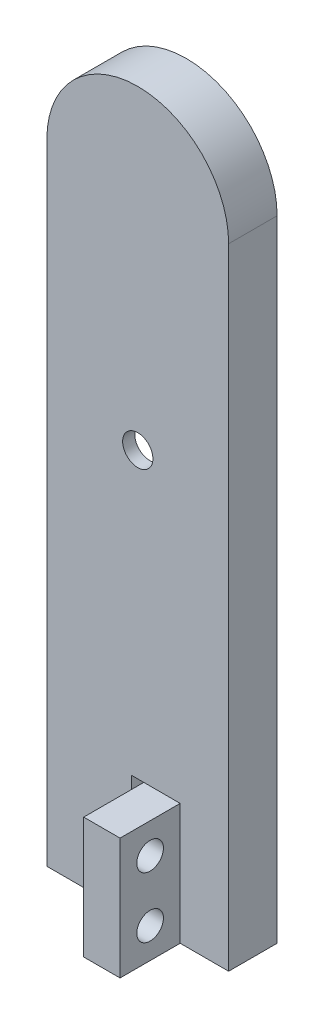
ISO-10303-21;
HEADER;
FILE_DESCRIPTION(('STEP AP214'),'2;1');
FILE_NAME('part.step','',(''),(''),'','','');
FILE_SCHEMA(('AUTOMOTIVE_DESIGN { 1 0 10303 214 1 1 1 1 }'));
ENDSEC;
DATA;
#1=APPLICATION_CONTEXT('core data for automotive mechanical design processes');
#2=APPLICATION_PROTOCOL_DEFINITION('international standard','automotive_design',2000,#1);
#3=PRODUCT_CONTEXT('',#1,'mechanical');
#4=PRODUCT('Part','Part','',(#3));
#5=PRODUCT_RELATED_PRODUCT_CATEGORY('part','',(#4));
#6=PRODUCT_DEFINITION_FORMATION('','',#4);
#7=PRODUCT_DEFINITION_CONTEXT('part definition',#1,'design');
#8=PRODUCT_DEFINITION('design','',#6,#7);
#9=PRODUCT_DEFINITION_SHAPE('','',#8);
#10=(LENGTH_UNIT() NAMED_UNIT(*) SI_UNIT(.MILLI.,.METRE.));
#11=(NAMED_UNIT(*) PLANE_ANGLE_UNIT() SI_UNIT($,.RADIAN.));
#12=(NAMED_UNIT(*) SI_UNIT($,.STERADIAN.) SOLID_ANGLE_UNIT());
#13=UNCERTAINTY_MEASURE_WITH_UNIT(LENGTH_MEASURE(1.E-05),#10,'distance_accuracy_value','');
#14=(GEOMETRIC_REPRESENTATION_CONTEXT(3) GLOBAL_UNCERTAINTY_ASSIGNED_CONTEXT((#13)) GLOBAL_UNIT_ASSIGNED_CONTEXT((#10,
#11,#12)) REPRESENTATION_CONTEXT('',''));
#15=CARTESIAN_POINT('',(0.,0.,0.));
#16=DIRECTION('',(0.,0.,1.));
#17=DIRECTION('',(1.,0.,0.));
#18=AXIS2_PLACEMENT_3D('',#15,#16,#17);
#19=CARTESIAN_POINT('',(0.,52.,4.));
#20=DIRECTION('',(0.,0.,1.));
#21=DIRECTION('',(1.,0.,0.));
#22=AXIS2_PLACEMENT_3D('',#19,#20,#21);
#23=PLANE('',#22);
#24=CARTESIAN_POINT('',(0.,33.5,4.));
#25=DIRECTION('',(0.,0.,1.));
#26=DIRECTION('',(1.,0.,0.));
#27=AXIS2_PLACEMENT_3D('',#24,#25,#26);
#28=CIRCLE('',#27,1.25);
#29=CARTESIAN_POINT('',(1.25,33.5,4.));
#30=VERTEX_POINT('',#29);
#31=EDGE_CURVE('E202',#30,#30,#28,.F.);
#32=ORIENTED_EDGE('',*,*,#31,.T.);
#33=EDGE_LOOP('',(#32));
#34=FACE_BOUND('',#33,.T.);
#35=DIRECTION('',(1.,0.,0.));
#36=VECTOR('',#35,1.);
#37=CARTESIAN_POINT('',(0.,10.,4.));
#38=LINE('',#37,#36);
#39=CARTESIAN_POINT('',(-0.499999999999999,10.,4.));
#40=VERTEX_POINT('',#39);
#41=CARTESIAN_POINT('',(0.499999999999999,10.,4.));
#42=VERTEX_POINT('',#41);
#43=EDGE_CURVE('E199',#40,#42,#38,.T.);
#44=ORIENTED_EDGE('',*,*,#43,.T.);
#45=DIRECTION('',(1.,0.,0.));
#46=VECTOR('',#45,1.);
#47=CARTESIAN_POINT('',(0.,10.,4.));
#48=LINE('',#47,#46);
#49=CARTESIAN_POINT('',(3.5,10.,4.));
#50=VERTEX_POINT('',#49);
#51=EDGE_CURVE('E53',#42,#50,#48,.T.);
#52=ORIENTED_EDGE('',*,*,#51,.T.);
#53=DIRECTION('',(0.,1.,0.));
#54=VECTOR('',#53,1.);
#55=CARTESIAN_POINT('',(3.5,52.,4.));
#56=LINE('',#55,#54);
#57=CARTESIAN_POINT('',(3.5,0.,4.));
#58=VERTEX_POINT('',#57);
#59=EDGE_CURVE('E11',#58,#50,#56,.T.);
#60=ORIENTED_EDGE('',*,*,#59,.F.);
#61=DIRECTION('',(1.,0.,0.));
#62=VECTOR('',#61,1.);
#63=CARTESIAN_POINT('',(7.5,0.,4.));
#64=LINE('',#63,#62);
#65=CARTESIAN_POINT('',(7.5,0.,4.));
#66=VERTEX_POINT('',#65);
#67=EDGE_CURVE('E157',#58,#66,#64,.T.);
#68=ORIENTED_EDGE('',*,*,#67,.T.);
#69=DIRECTION('',(0.,1.,0.));
#70=VECTOR('',#69,1.);
#71=CARTESIAN_POINT('',(7.5,0.,4.));
#72=LINE('',#71,#70);
#73=CARTESIAN_POINT('',(7.5,52.,4.));
#74=VERTEX_POINT('',#73);
#75=EDGE_CURVE('E253',#66,#74,#72,.T.);
#76=ORIENTED_EDGE('',*,*,#75,.T.);
#77=CARTESIAN_POINT('',(0.,52.,4.));
#78=DIRECTION('',(0.,0.,1.));
#79=DIRECTION('',(1.,0.,0.));
#80=AXIS2_PLACEMENT_3D('',#77,#78,#79);
#81=CIRCLE('',#80,7.5);
#82=CARTESIAN_POINT('',(-7.5,52.,4.));
#83=VERTEX_POINT('',#82);
#84=EDGE_CURVE('E255',#74,#83,#81,.T.);
#85=ORIENTED_EDGE('',*,*,#84,.T.);
#86=DIRECTION('',(0.,-1.,0.));
#87=VECTOR('',#86,1.);
#88=CARTESIAN_POINT('',(-7.5,0.,4.));
#89=LINE('',#88,#87);
#90=CARTESIAN_POINT('',(-7.5,0.,4.));
#91=VERTEX_POINT('',#90);
#92=EDGE_CURVE('E257',#83,#91,#89,.T.);
#93=ORIENTED_EDGE('',*,*,#92,.T.);
#94=CARTESIAN_POINT('',(-0.5,0.,4.));
#95=VERTEX_POINT('',#94);
#96=EDGE_CURVE('E250',#91,#95,#64,.T.);
#97=ORIENTED_EDGE('',*,*,#96,.T.);
#98=DIRECTION('',(0.,1.,0.));
#99=VECTOR('',#98,1.);
#100=CARTESIAN_POINT('',(-0.499999999999997,52.,4.));
#101=LINE('',#100,#99);
#102=EDGE_CURVE('E196',#95,#40,#101,.T.);
#103=ORIENTED_EDGE('',*,*,#102,.T.);
#104=EDGE_LOOP('',(#44,#52,#60,#68,#76,#85,#93,#97,#103));
#105=FACE_BOUND('',#104,.T.);
#106=ADVANCED_FACE('F36',(#34,#105),#23,.T.);
#107=CARTESIAN_POINT('',(7.5,0.,4.));
#108=DIRECTION('',(0.,1.,0.));
#109=DIRECTION('',(0.,0.,1.));
#110=AXIS2_PLACEMENT_3D('',#107,#108,#109);
#111=PLANE('',#110);
#112=DIRECTION('',(0.,0.,-1.));
#113=VECTOR('',#112,1.);
#114=CARTESIAN_POINT('',(0.5,0.,16.3));
#115=LINE('',#114,#113);
#116=CARTESIAN_POINT('',(0.5,0.,8.96178465974861));
#117=VERTEX_POINT('',#116);
#118=CARTESIAN_POINT('',(0.5,0.,0.));
#119=VERTEX_POINT('',#118);
#120=EDGE_CURVE('E194',#117,#119,#115,.T.);
#121=ORIENTED_EDGE('',*,*,#120,.T.);
#122=DIRECTION('',(1.,0.,0.));
#123=VECTOR('',#122,1.);
#124=CARTESIAN_POINT('',(7.5,0.,0.));
#125=LINE('',#124,#123);
#126=CARTESIAN_POINT('',(7.5,0.,0.));
#127=VERTEX_POINT('',#126);
#128=EDGE_CURVE('E249',#119,#127,#125,.T.);
#129=ORIENTED_EDGE('',*,*,#128,.T.);
#130=DIRECTION('',(0.,0.,-1.));
#131=VECTOR('',#130,1.);
#132=CARTESIAN_POINT('',(7.5,0.,4.));
#133=LINE('',#132,#131);
#134=EDGE_CURVE('E45',#66,#127,#133,.T.);
#135=ORIENTED_EDGE('',*,*,#134,.F.);
#136=ORIENTED_EDGE('',*,*,#67,.F.);
#137=DIRECTION('',(0.,0.,-1.));
#138=VECTOR('',#137,1.);
#139=CARTESIAN_POINT('',(3.5,0.,8.96178465974861));
#140=LINE('',#139,#138);
#141=CARTESIAN_POINT('',(3.5,0.,8.96178465974861));
#142=VERTEX_POINT('',#141);
#143=EDGE_CURVE('E151',#142,#58,#140,.T.);
#144=ORIENTED_EDGE('',*,*,#143,.F.);
#145=DIRECTION('',(-1.,0.,0.));
#146=VECTOR('',#145,1.);
#147=CARTESIAN_POINT('',(3.5,0.,8.96178465974861));
#148=LINE('',#147,#146);
#149=EDGE_CURVE('E154',#142,#117,#148,.T.);
#150=ORIENTED_EDGE('',*,*,#149,.T.);
#151=EDGE_LOOP('',(#121,#129,#135,#136,#144,#150));
#152=FACE_BOUND('',#151,.T.);
#153=ADVANCED_FACE('F38',(#152),#111,.F.);
#154=DIRECTION('',(0.,0.,-1.));
#155=VECTOR('',#154,1.);
#156=CARTESIAN_POINT('',(-0.5,0.,16.3));
#157=LINE('',#156,#155);
#158=CARTESIAN_POINT('',(-0.499999999999999,0.,0.));
#159=VERTEX_POINT('',#158);
#160=EDGE_CURVE('E188',#95,#159,#157,.T.);
#161=ORIENTED_EDGE('',*,*,#160,.F.);
#162=ORIENTED_EDGE('',*,*,#96,.F.);
#163=DIRECTION('',(0.,0.,-1.));
#164=VECTOR('',#163,1.);
#165=CARTESIAN_POINT('',(-7.5,0.,4.));
#166=LINE('',#165,#164);
#167=CARTESIAN_POINT('',(-7.5,0.,0.));
#168=VERTEX_POINT('',#167);
#169=EDGE_CURVE('E259',#91,#168,#166,.T.);
#170=ORIENTED_EDGE('',*,*,#169,.T.);
#171=EDGE_CURVE('E260',#168,#159,#125,.T.);
#172=ORIENTED_EDGE('',*,*,#171,.T.);
#173=EDGE_LOOP('',(#161,#162,#170,#172));
#174=FACE_BOUND('',#173,.T.);
#175=ADVANCED_FACE('F323',(#174),#111,.F.);
#176=CARTESIAN_POINT('',(0.,52.,0.));
#177=DIRECTION('',(0.,0.,1.));
#178=DIRECTION('',(1.,0.,0.));
#179=AXIS2_PLACEMENT_3D('',#176,#177,#178);
#180=PLANE('',#179);
#181=DIRECTION('',(-0.161684528353419,0.986842496699009,0.));
#182=VECTOR('',#181,1.);
#183=CARTESIAN_POINT('',(10.214455548325,1.67353902293651,0.));
#184=LINE('',#183,#182);
#185=CARTESIAN_POINT('',(5.,33.5,0.));
#186=VERTEX_POINT('',#185);
#187=CARTESIAN_POINT('',(2.29663575823377,50.,0.));
#188=VERTEX_POINT('',#187);
#189=EDGE_CURVE('E210',#186,#188,#184,.T.);
#190=ORIENTED_EDGE('',*,*,#189,.T.);
#191=CARTESIAN_POINT('',(0.,50.,0.));
#192=DIRECTION('',(0.,0.,1.));
#193=DIRECTION('',(1.,0.,0.));
#194=AXIS2_PLACEMENT_3D('',#191,#192,#193);
#195=CIRCLE('',#194,2.29663575823377);
#196=CARTESIAN_POINT('',(-2.29663575823377,50.,0.));
#197=VERTEX_POINT('',#196);
#198=EDGE_CURVE('E205',#197,#188,#195,.F.);
#199=ORIENTED_EDGE('',*,*,#198,.F.);
#200=DIRECTION('',(-0.161684528353419,-0.986842496699009,0.));
#201=VECTOR('',#200,1.);
#202=CARTESIAN_POINT('',(-10.214455548325,1.67353902293651,0.));
#203=LINE('',#202,#201);
#204=CARTESIAN_POINT('',(-5.,33.5,0.));
#205=VERTEX_POINT('',#204);
#206=EDGE_CURVE('E223',#197,#205,#203,.T.);
#207=ORIENTED_EDGE('',*,*,#206,.T.);
#208=DIRECTION('',(0.161380696641222,-0.986892228539466,0.));
#209=VECTOR('',#208,1.);
#210=CARTESIAN_POINT('',(0.465608050517505,0.0761381530640669,0.));
#211=LINE('',#210,#209);
#212=CARTESIAN_POINT('',(-2.30185179538713,17.,0.));
#213=VERTEX_POINT('',#212);
#214=EDGE_CURVE('E226',#205,#213,#211,.T.);
#215=ORIENTED_EDGE('',*,*,#214,.T.);
#216=CARTESIAN_POINT('',(0.,17.,0.));
#217=DIRECTION('',(0.,0.,1.));
#218=DIRECTION('',(1.,0.,0.));
#219=AXIS2_PLACEMENT_3D('',#216,#217,#218);
#220=CIRCLE('',#219,2.30185179538713);
#221=CARTESIAN_POINT('',(2.27233199291966,16.6325370741411,0.));
#222=VERTEX_POINT('',#221);
#223=EDGE_CURVE('E229',#213,#222,#220,.T.);
#224=ORIENTED_EDGE('',*,*,#223,.T.);
#225=DIRECTION('',(-0.159637960443524,-0.987175628541057,0.));
#226=VECTOR('',#225,1.);
#227=CARTESIAN_POINT('',(-0.40670997405777,0.0657698071887931,0.));
#228=LINE('',#227,#226);
#229=EDGE_CURVE('E232',#186,#222,#228,.T.);
#230=ORIENTED_EDGE('',*,*,#229,.F.);
#231=EDGE_LOOP('',(#190,#199,#207,#215,#224,#230));
#232=FACE_BOUND('',#231,.T.);
#233=DIRECTION('',(0.,1.,0.));
#234=VECTOR('',#233,1.);
#235=CARTESIAN_POINT('',(0.5,0.,0.));
#236=LINE('',#235,#234);
#237=CARTESIAN_POINT('',(0.499999999999999,10.,0.));
#238=VERTEX_POINT('',#237);
#239=EDGE_CURVE('E175',#119,#238,#236,.T.);
#240=ORIENTED_EDGE('',*,*,#239,.T.);
#241=DIRECTION('',(-1.,0.,0.));
#242=VECTOR('',#241,1.);
#243=CARTESIAN_POINT('',(0.499999999999999,10.,0.));
#244=LINE('',#243,#242);
#245=CARTESIAN_POINT('',(-0.499999999999999,10.,0.));
#246=VERTEX_POINT('',#245);
#247=EDGE_CURVE('E182',#238,#246,#244,.T.);
#248=ORIENTED_EDGE('',*,*,#247,.T.);
#249=DIRECTION('',(0.,-1.,0.));
#250=VECTOR('',#249,1.);
#251=CARTESIAN_POINT('',(-0.5,0.,0.));
#252=LINE('',#251,#250);
#253=EDGE_CURVE('E185',#246,#159,#252,.T.);
#254=ORIENTED_EDGE('',*,*,#253,.T.);
#255=ORIENTED_EDGE('',*,*,#171,.F.);
#256=DIRECTION('',(0.,-1.,0.));
#257=VECTOR('',#256,1.);
#258=CARTESIAN_POINT('',(-7.5,0.,0.));
#259=LINE('',#258,#257);
#260=CARTESIAN_POINT('',(-7.5,52.,0.));
#261=VERTEX_POINT('',#260);
#262=EDGE_CURVE('E267',#261,#168,#259,.T.);
#263=ORIENTED_EDGE('',*,*,#262,.F.);
#264=CARTESIAN_POINT('',(0.,52.,0.));
#265=DIRECTION('',(0.,0.,1.));
#266=DIRECTION('',(1.,0.,0.));
#267=AXIS2_PLACEMENT_3D('',#264,#265,#266);
#268=CIRCLE('',#267,7.5);
#269=CARTESIAN_POINT('',(7.5,52.,0.));
#270=VERTEX_POINT('',#269);
#271=EDGE_CURVE('E265',#270,#261,#268,.T.);
#272=ORIENTED_EDGE('',*,*,#271,.F.);
#273=DIRECTION('',(0.,1.,0.));
#274=VECTOR('',#273,1.);
#275=CARTESIAN_POINT('',(7.5,0.,0.));
#276=LINE('',#275,#274);
#277=EDGE_CURVE('E263',#127,#270,#276,.T.);
#278=ORIENTED_EDGE('',*,*,#277,.F.);
#279=ORIENTED_EDGE('',*,*,#128,.F.);
#280=EDGE_LOOP('',(#240,#248,#254,#255,#263,#272,#278,#279));
#281=FACE_BOUND('',#280,.T.);
#282=ADVANCED_FACE('F305',(#232,#281),#180,.F.);
#283=CARTESIAN_POINT('',(7.5,0.,4.));
#284=DIRECTION('',(-1.,0.,0.));
#285=DIRECTION('',(0.,0.,1.));
#286=AXIS2_PLACEMENT_3D('',#283,#284,#285);
#287=PLANE('',#286);
#288=ORIENTED_EDGE('',*,*,#277,.T.);
#289=DIRECTION('',(0.,0.,-1.));
#290=VECTOR('',#289,1.);
#291=CARTESIAN_POINT('',(7.5,52.,4.));
#292=LINE('',#291,#290);
#293=EDGE_CURVE('E274',#74,#270,#292,.T.);
#294=ORIENTED_EDGE('',*,*,#293,.F.);
#295=ORIENTED_EDGE('',*,*,#75,.F.);
#296=ORIENTED_EDGE('',*,*,#134,.T.);
#297=EDGE_LOOP('',(#288,#294,#295,#296));
#298=FACE_BOUND('',#297,.T.);
#299=ADVANCED_FACE('F310',(#298),#287,.F.);
#300=CARTESIAN_POINT('',(0.,52.,4.));
#301=DIRECTION('',(0.,0.,-1.));
#302=DIRECTION('',(-1.,0.,0.));
#303=AXIS2_PLACEMENT_3D('',#300,#301,#302);
#304=CYLINDRICAL_SURFACE('',#303,7.5);
#305=ORIENTED_EDGE('',*,*,#271,.T.);
#306=DIRECTION('',(0.,0.,-1.));
#307=VECTOR('',#306,1.);
#308=CARTESIAN_POINT('',(-7.5,52.,4.));
#309=LINE('',#308,#307);
#310=EDGE_CURVE('E271',#83,#261,#309,.T.);
#311=ORIENTED_EDGE('',*,*,#310,.F.);
#312=ORIENTED_EDGE('',*,*,#84,.F.);
#313=ORIENTED_EDGE('',*,*,#293,.T.);
#314=EDGE_LOOP('',(#305,#311,#312,#313));
#315=FACE_BOUND('',#314,.T.);
#316=ADVANCED_FACE('F316',(#315),#304,.T.);
#317=CARTESIAN_POINT('',(-7.5,0.,4.));
#318=DIRECTION('',(1.,0.,0.));
#319=DIRECTION('',(0.,0.,-1.));
#320=AXIS2_PLACEMENT_3D('',#317,#318,#319);
#321=PLANE('',#320);
#322=ORIENTED_EDGE('',*,*,#262,.T.);
#323=ORIENTED_EDGE('',*,*,#169,.F.);
#324=ORIENTED_EDGE('',*,*,#92,.F.);
#325=ORIENTED_EDGE('',*,*,#310,.T.);
#326=EDGE_LOOP('',(#322,#323,#324,#325));
#327=FACE_BOUND('',#326,.T.);
#328=ADVANCED_FACE('F318',(#327),#321,.F.);
#329=CARTESIAN_POINT('',(0.,50.,3.));
#330=DIRECTION('',(0.,0.,-1.));
#331=DIRECTION('',(-1.,0.,0.));
#332=AXIS2_PLACEMENT_3D('',#329,#330,#331);
#333=CYLINDRICAL_SURFACE('',#332,2.29663575823377);
#334=ORIENTED_EDGE('',*,*,#198,.T.);
#335=DIRECTION('',(0.,0.,-1.));
#336=VECTOR('',#335,1.);
#337=CARTESIAN_POINT('',(2.29663575823377,50.,3.));
#338=LINE('',#337,#336);
#339=CARTESIAN_POINT('',(2.29663575823377,50.,3.));
#340=VERTEX_POINT('',#339);
#341=EDGE_CURVE('E221',#340,#188,#338,.T.);
#342=ORIENTED_EDGE('',*,*,#341,.F.);
#343=CARTESIAN_POINT('',(0.,50.,3.));
#344=DIRECTION('',(0.,0.,1.));
#345=DIRECTION('',(1.,0.,0.));
#346=AXIS2_PLACEMENT_3D('',#343,#344,#345);
#347=CIRCLE('',#346,2.29663575823377);
#348=CARTESIAN_POINT('',(-2.29663575823377,50.,3.));
#349=VERTEX_POINT('',#348);
#350=EDGE_CURVE('E206',#349,#340,#347,.F.);
#351=ORIENTED_EDGE('',*,*,#350,.F.);
#352=DIRECTION('',(0.,0.,-1.));
#353=VECTOR('',#352,1.);
#354=CARTESIAN_POINT('',(-2.29663575823377,50.,3.));
#355=LINE('',#354,#353);
#356=EDGE_CURVE('E247',#349,#197,#355,.T.);
#357=ORIENTED_EDGE('',*,*,#356,.T.);
#358=EDGE_LOOP('',(#334,#342,#351,#357));
#359=FACE_BOUND('',#358,.T.);
#360=ADVANCED_FACE('F348',(#359),#333,.F.);
#361=CARTESIAN_POINT('',(-10.214455548325,1.67353902293651,3.));
#362=DIRECTION('',(0.986842496699008,-0.161684528353419,0.));
#363=DIRECTION('',(0.161684528353419,0.986842496699008,0.));
#364=AXIS2_PLACEMENT_3D('',#361,#362,#363);
#365=PLANE('',#364);
#366=ORIENTED_EDGE('',*,*,#206,.F.);
#367=ORIENTED_EDGE('',*,*,#356,.F.);
#368=DIRECTION('',(-0.161684528353419,-0.986842496699009,0.));
#369=VECTOR('',#368,1.);
#370=CARTESIAN_POINT('',(-10.214455548325,1.67353902293651,3.));
#371=LINE('',#370,#369);
#372=CARTESIAN_POINT('',(-5.,33.5,3.));
#373=VERTEX_POINT('',#372);
#374=EDGE_CURVE('E209',#349,#373,#371,.T.);
#375=ORIENTED_EDGE('',*,*,#374,.T.);
#376=DIRECTION('',(0.,0.,-1.));
#377=VECTOR('',#376,1.);
#378=CARTESIAN_POINT('',(-5.,33.5,3.));
#379=LINE('',#378,#377);
#380=EDGE_CURVE('E245',#373,#205,#379,.T.);
#381=ORIENTED_EDGE('',*,*,#380,.T.);
#382=EDGE_LOOP('',(#366,#367,#375,#381));
#383=FACE_BOUND('',#382,.T.);
#384=ADVANCED_FACE('F376',(#383),#365,.T.);
#385=CARTESIAN_POINT('',(0.465608050517505,0.0761381530640669,3.));
#386=DIRECTION('',(0.986892228539466,0.161380696641222,0.));
#387=DIRECTION('',(-0.161380696641222,0.986892228539466,0.));
#388=AXIS2_PLACEMENT_3D('',#385,#386,#387);
#389=PLANE('',#388);
#390=ORIENTED_EDGE('',*,*,#214,.F.);
#391=ORIENTED_EDGE('',*,*,#380,.F.);
#392=DIRECTION('',(0.161380696641222,-0.986892228539466,0.));
#393=VECTOR('',#392,1.);
#394=CARTESIAN_POINT('',(0.465608050517505,0.0761381530640669,3.));
#395=LINE('',#394,#393);
#396=CARTESIAN_POINT('',(-2.30185179538713,17.,3.));
#397=VERTEX_POINT('',#396);
#398=EDGE_CURVE('E212',#373,#397,#395,.T.);
#399=ORIENTED_EDGE('',*,*,#398,.T.);
#400=DIRECTION('',(0.,0.,-1.));
#401=VECTOR('',#400,1.);
#402=CARTESIAN_POINT('',(-2.30185179538713,17.,3.));
#403=LINE('',#402,#401);
#404=EDGE_CURVE('E243',#397,#213,#403,.T.);
#405=ORIENTED_EDGE('',*,*,#404,.T.);
#406=EDGE_LOOP('',(#390,#391,#399,#405));
#407=FACE_BOUND('',#406,.T.);
#408=ADVANCED_FACE('F383',(#407),#389,.T.);
#409=CARTESIAN_POINT('',(0.,17.,3.));
#410=DIRECTION('',(0.,0.,-1.));
#411=DIRECTION('',(-1.,0.,0.));
#412=AXIS2_PLACEMENT_3D('',#409,#410,#411);
#413=CYLINDRICAL_SURFACE('',#412,2.30185179538713);
#414=ORIENTED_EDGE('',*,*,#223,.F.);
#415=ORIENTED_EDGE('',*,*,#404,.F.);
#416=CARTESIAN_POINT('',(0.,17.,3.));
#417=DIRECTION('',(0.,0.,1.));
#418=DIRECTION('',(1.,0.,0.));
#419=AXIS2_PLACEMENT_3D('',#416,#417,#418);
#420=CIRCLE('',#419,2.30185179538713);
#421=CARTESIAN_POINT('',(2.27233199291966,16.6325370741411,3.));
#422=VERTEX_POINT('',#421);
#423=EDGE_CURVE('E214',#397,#422,#420,.T.);
#424=ORIENTED_EDGE('',*,*,#423,.T.);
#425=DIRECTION('',(0.,0.,-1.));
#426=VECTOR('',#425,1.);
#427=CARTESIAN_POINT('',(2.27233199291966,16.6325370741411,3.));
#428=LINE('',#427,#426);
#429=EDGE_CURVE('E241',#422,#222,#428,.T.);
#430=ORIENTED_EDGE('',*,*,#429,.T.);
#431=EDGE_LOOP('',(#414,#415,#424,#430));
#432=FACE_BOUND('',#431,.T.);
#433=ADVANCED_FACE('F390',(#432),#413,.F.);
#434=CARTESIAN_POINT('',(-0.40670997405777,0.0657698071887931,3.));
#435=DIRECTION('',(0.987175628541057,-0.159637960443524,0.));
#436=DIRECTION('',(0.159637960443524,0.987175628541057,0.));
#437=AXIS2_PLACEMENT_3D('',#434,#435,#436);
#438=PLANE('',#437);
#439=ORIENTED_EDGE('',*,*,#229,.T.);
#440=ORIENTED_EDGE('',*,*,#429,.F.);
#441=DIRECTION('',(-0.159637960443524,-0.987175628541057,0.));
#442=VECTOR('',#441,1.);
#443=CARTESIAN_POINT('',(-0.40670997405777,0.0657698071887931,3.));
#444=LINE('',#443,#442);
#445=CARTESIAN_POINT('',(5.,33.5,3.));
#446=VERTEX_POINT('',#445);
#447=EDGE_CURVE('E216',#446,#422,#444,.T.);
#448=ORIENTED_EDGE('',*,*,#447,.F.);
#449=DIRECTION('',(0.,0.,-1.));
#450=VECTOR('',#449,1.);
#451=CARTESIAN_POINT('',(5.,33.5,3.));
#452=LINE('',#451,#450);
#453=EDGE_CURVE('E239',#446,#186,#452,.T.);
#454=ORIENTED_EDGE('',*,*,#453,.T.);
#455=EDGE_LOOP('',(#439,#440,#448,#454));
#456=FACE_BOUND('',#455,.T.);
#457=ADVANCED_FACE('F398',(#456),#438,.F.);
#458=CARTESIAN_POINT('',(10.214455548325,1.67353902293651,3.));
#459=DIRECTION('',(-0.986842496699008,-0.161684528353419,0.));
#460=DIRECTION('',(0.161684528353419,-0.986842496699008,0.));
#461=AXIS2_PLACEMENT_3D('',#458,#459,#460);
#462=PLANE('',#461);
#463=ORIENTED_EDGE('',*,*,#189,.F.);
#464=ORIENTED_EDGE('',*,*,#453,.F.);
#465=DIRECTION('',(-0.161684528353419,0.986842496699009,0.));
#466=VECTOR('',#465,1.);
#467=CARTESIAN_POINT('',(10.214455548325,1.67353902293651,3.));
#468=LINE('',#467,#466);
#469=EDGE_CURVE('E219',#446,#340,#468,.T.);
#470=ORIENTED_EDGE('',*,*,#469,.T.);
#471=ORIENTED_EDGE('',*,*,#341,.T.);
#472=EDGE_LOOP('',(#463,#464,#470,#471));
#473=FACE_BOUND('',#472,.T.);
#474=ADVANCED_FACE('F406',(#473),#462,.T.);
#475=CARTESIAN_POINT('',(0.,0.,3.));
#476=DIRECTION('',(0.,0.,1.));
#477=DIRECTION('',(1.,0.,0.));
#478=AXIS2_PLACEMENT_3D('',#475,#476,#477);
#479=PLANE('',#478);
#480=CARTESIAN_POINT('',(0.,33.5,3.));
#481=DIRECTION('',(0.,0.,1.));
#482=DIRECTION('',(1.,0.,0.));
#483=AXIS2_PLACEMENT_3D('',#480,#481,#482);
#484=CIRCLE('',#483,1.25);
#485=CARTESIAN_POINT('',(1.25,33.5,3.));
#486=VERTEX_POINT('',#485);
#487=EDGE_CURVE('E201',#486,#486,#484,.F.);
#488=ORIENTED_EDGE('',*,*,#487,.F.);
#489=EDGE_LOOP('',(#488));
#490=FACE_BOUND('',#489,.T.);
#491=ORIENTED_EDGE('',*,*,#350,.T.);
#492=ORIENTED_EDGE('',*,*,#469,.F.);
#493=ORIENTED_EDGE('',*,*,#447,.T.);
#494=ORIENTED_EDGE('',*,*,#423,.F.);
#495=ORIENTED_EDGE('',*,*,#398,.F.);
#496=ORIENTED_EDGE('',*,*,#374,.F.);
#497=EDGE_LOOP('',(#491,#492,#493,#494,#495,#496));
#498=FACE_BOUND('',#497,.T.);
#499=ADVANCED_FACE('F414',(#490,#498),#479,.F.);
#500=CARTESIAN_POINT('',(0.,33.5,12.4));
#501=DIRECTION('',(0.,0.,-1.));
#502=DIRECTION('',(-1.,0.,0.));
#503=AXIS2_PLACEMENT_3D('',#500,#501,#502);
#504=CYLINDRICAL_SURFACE('',#503,1.25);
#505=ORIENTED_EDGE('',*,*,#31,.F.);
#506=EDGE_LOOP('',(#505));
#507=FACE_BOUND('',#506,.T.);
#508=ORIENTED_EDGE('',*,*,#487,.T.);
#509=EDGE_LOOP('',(#508));
#510=FACE_BOUND('',#509,.T.);
#511=ADVANCED_FACE('F338',(#507,#510),#504,.F.);
#512=CARTESIAN_POINT('',(0.5,0.,16.3));
#513=DIRECTION('',(-1.,0.,0.));
#514=DIRECTION('',(0.,-1.,0.));
#515=AXIS2_PLACEMENT_3D('',#512,#513,#514);
#516=PLANE('',#515);
#517=CARTESIAN_POINT('',(0.5,7.5,6.48089232987431));
#518=DIRECTION('',(1.,0.,0.));
#519=DIRECTION('',(0.,0.,-1.));
#520=AXIS2_PLACEMENT_3D('',#517,#518,#519);
#521=CIRCLE('',#520,1.1);
#522=CARTESIAN_POINT('',(0.5,7.5,5.38089232987431));
#523=VERTEX_POINT('',#522);
#524=EDGE_CURVE('E282',#523,#523,#521,.T.);
#525=ORIENTED_EDGE('',*,*,#524,.T.);
#526=EDGE_LOOP('',(#525));
#527=FACE_BOUND('',#526,.T.);
#528=CARTESIAN_POINT('',(0.5,2.5,6.48089232987431));
#529=DIRECTION('',(1.,0.,0.));
#530=DIRECTION('',(0.,0.,1.));
#531=AXIS2_PLACEMENT_3D('',#528,#529,#530);
#532=CIRCLE('',#531,1.1);
#533=CARTESIAN_POINT('',(0.5,2.5,7.58089232987431));
#534=VERTEX_POINT('',#533);
#535=EDGE_CURVE('E287',#534,#534,#532,.T.);
#536=ORIENTED_EDGE('',*,*,#535,.T.);
#537=EDGE_LOOP('',(#536));
#538=FACE_BOUND('',#537,.T.);
#539=DIRECTION('',(0.,0.,-1.));
#540=VECTOR('',#539,1.);
#541=CARTESIAN_POINT('',(0.499999999999999,10.,16.3));
#542=LINE('',#541,#540);
#543=EDGE_CURVE('E192',#42,#238,#542,.T.);
#544=ORIENTED_EDGE('',*,*,#543,.T.);
#545=ORIENTED_EDGE('',*,*,#239,.F.);
#546=ORIENTED_EDGE('',*,*,#120,.F.);
#547=DIRECTION('',(0.,-1.,0.));
#548=VECTOR('',#547,1.);
#549=CARTESIAN_POINT('',(0.5,10.,8.96178465974861));
#550=LINE('',#549,#548);
#551=CARTESIAN_POINT('',(0.5,10.,8.96178465974861));
#552=VERTEX_POINT('',#551);
#553=EDGE_CURVE('E172',#552,#117,#550,.T.);
#554=ORIENTED_EDGE('',*,*,#553,.F.);
#555=DIRECTION('',(0.,0.,1.));
#556=VECTOR('',#555,1.);
#557=CARTESIAN_POINT('',(0.5,10.,8.96178465974861));
#558=LINE('',#557,#556);
#559=EDGE_CURVE('E168',#42,#552,#558,.T.);
#560=ORIENTED_EDGE('',*,*,#559,.F.);
#561=EDGE_LOOP('',(#544,#545,#546,#554,#560));
#562=FACE_BOUND('',#561,.T.);
#563=ADVANCED_FACE('F299',(#527,#538,#562),#516,.T.);
#564=CARTESIAN_POINT('',(0.499999999999999,10.,16.3));
#565=DIRECTION('',(0.,-1.,0.));
#566=DIRECTION('',(0.,0.,-1.));
#567=AXIS2_PLACEMENT_3D('',#564,#565,#566);
#568=PLANE('',#567);
#569=DIRECTION('',(0.,0.,-1.));
#570=VECTOR('',#569,1.);
#571=CARTESIAN_POINT('',(-0.499999999999999,10.,16.3));
#572=LINE('',#571,#570);
#573=EDGE_CURVE('E190',#40,#246,#572,.T.);
#574=ORIENTED_EDGE('',*,*,#573,.T.);
#575=ORIENTED_EDGE('',*,*,#247,.F.);
#576=ORIENTED_EDGE('',*,*,#543,.F.);
#577=ORIENTED_EDGE('',*,*,#43,.F.);
#578=EDGE_LOOP('',(#574,#575,#576,#577));
#579=FACE_BOUND('',#578,.T.);
#580=ADVANCED_FACE('F330',(#579),#568,.T.);
#581=CARTESIAN_POINT('',(-0.5,0.,16.3));
#582=DIRECTION('',(1.,0.,0.));
#583=DIRECTION('',(0.,1.,0.));
#584=AXIS2_PLACEMENT_3D('',#581,#582,#583);
#585=PLANE('',#584);
#586=ORIENTED_EDGE('',*,*,#160,.T.);
#587=ORIENTED_EDGE('',*,*,#253,.F.);
#588=ORIENTED_EDGE('',*,*,#573,.F.);
#589=ORIENTED_EDGE('',*,*,#102,.F.);
#590=EDGE_LOOP('',(#586,#587,#588,#589));
#591=FACE_BOUND('',#590,.T.);
#592=ADVANCED_FACE('F326',(#591),#585,.T.);
#593=CARTESIAN_POINT('',(3.5,10.,8.96178465974861));
#594=DIRECTION('',(0.,0.,-1.));
#595=DIRECTION('',(-1.,0.,0.));
#596=AXIS2_PLACEMENT_3D('',#593,#594,#595);
#597=PLANE('',#596);
#598=ORIENTED_EDGE('',*,*,#553,.T.);
#599=ORIENTED_EDGE('',*,*,#149,.F.);
#600=DIRECTION('',(0.,-1.,0.));
#601=VECTOR('',#600,1.);
#602=CARTESIAN_POINT('',(3.5,10.,8.96178465974861));
#603=LINE('',#602,#601);
#604=CARTESIAN_POINT('',(3.5,10.,8.96178465974861));
#605=VERTEX_POINT('',#604);
#606=EDGE_CURVE('E160',#605,#142,#603,.T.);
#607=ORIENTED_EDGE('',*,*,#606,.F.);
#608=DIRECTION('',(-1.,0.,0.));
#609=VECTOR('',#608,1.);
#610=CARTESIAN_POINT('',(3.5,10.,8.96178465974861));
#611=LINE('',#610,#609);
#612=EDGE_CURVE('E173',#605,#552,#611,.T.);
#613=ORIENTED_EDGE('',*,*,#612,.T.);
#614=EDGE_LOOP('',(#598,#599,#607,#613));
#615=FACE_BOUND('',#614,.T.);
#616=ADVANCED_FACE('F170',(#615),#597,.F.);
#617=CARTESIAN_POINT('',(3.5,10.,8.96178465974861));
#618=DIRECTION('',(0.,-1.,0.));
#619=DIRECTION('',(0.,0.,-1.));
#620=AXIS2_PLACEMENT_3D('',#617,#618,#619);
#621=PLANE('',#620);
#622=ORIENTED_EDGE('',*,*,#51,.F.);
#623=ORIENTED_EDGE('',*,*,#559,.T.);
#624=ORIENTED_EDGE('',*,*,#612,.F.);
#625=DIRECTION('',(0.,0.,1.));
#626=VECTOR('',#625,1.);
#627=CARTESIAN_POINT('',(3.5,10.,8.96178465974861));
#628=LINE('',#627,#626);
#629=EDGE_CURVE('E159',#50,#605,#628,.T.);
#630=ORIENTED_EDGE('',*,*,#629,.F.);
#631=EDGE_LOOP('',(#622,#623,#624,#630));
#632=FACE_BOUND('',#631,.T.);
#633=ADVANCED_FACE('F297',(#632),#621,.F.);
#634=CARTESIAN_POINT('',(3.5,0.,0.));
#635=DIRECTION('',(1.,0.,0.));
#636=DIRECTION('',(0.,0.,-1.));
#637=AXIS2_PLACEMENT_3D('',#634,#635,#636);
#638=PLANE('',#637);
#639=CARTESIAN_POINT('',(3.5,7.5,6.48089232987431));
#640=DIRECTION('',(1.,0.,0.));
#641=DIRECTION('',(0.,0.,-1.));
#642=AXIS2_PLACEMENT_3D('',#639,#640,#641);
#643=CIRCLE('',#642,1.1);
#644=CARTESIAN_POINT('',(3.5,7.5,5.38089232987431));
#645=VERTEX_POINT('',#644);
#646=EDGE_CURVE('E40',#645,#645,#643,.F.);
#647=ORIENTED_EDGE('',*,*,#646,.T.);
#648=EDGE_LOOP('',(#647));
#649=FACE_BOUND('',#648,.T.);
#650=CARTESIAN_POINT('',(3.5,2.5,6.48089232987431));
#651=DIRECTION('',(1.,0.,0.));
#652=DIRECTION('',(0.,0.,-1.));
#653=AXIS2_PLACEMENT_3D('',#650,#651,#652);
#654=CIRCLE('',#653,1.1);
#655=CARTESIAN_POINT('',(3.5,2.5,5.38089232987431));
#656=VERTEX_POINT('',#655);
#657=EDGE_CURVE('E280',#656,#656,#654,.F.);
#658=ORIENTED_EDGE('',*,*,#657,.T.);
#659=EDGE_LOOP('',(#658));
#660=FACE_BOUND('',#659,.T.);
#661=ORIENTED_EDGE('',*,*,#143,.T.);
#662=ORIENTED_EDGE('',*,*,#59,.T.);
#663=ORIENTED_EDGE('',*,*,#629,.T.);
#664=ORIENTED_EDGE('',*,*,#606,.T.);
#665=EDGE_LOOP('',(#661,#662,#663,#664));
#666=FACE_BOUND('',#665,.T.);
#667=ADVANCED_FACE('F163',(#649,#660,#666),#638,.T.);
#668=CARTESIAN_POINT('',(5.6,2.5,6.48089232987431));
#669=DIRECTION('',(-1.,0.,0.));
#670=DIRECTION('',(0.,0.,1.));
#671=AXIS2_PLACEMENT_3D('',#668,#669,#670);
#672=CYLINDRICAL_SURFACE('',#671,1.1);
#673=ORIENTED_EDGE('',*,*,#657,.F.);
#674=EDGE_LOOP('',(#673));
#675=FACE_BOUND('',#674,.T.);
#676=ORIENTED_EDGE('',*,*,#535,.F.);
#677=EDGE_LOOP('',(#676));
#678=FACE_BOUND('',#677,.T.);
#679=ADVANCED_FACE('F452',(#675,#678),#672,.F.);
#680=CARTESIAN_POINT('',(5.6,7.5,6.48089232987431));
#681=DIRECTION('',(-1.,0.,0.));
#682=DIRECTION('',(0.,0.,1.));
#683=AXIS2_PLACEMENT_3D('',#680,#681,#682);
#684=CYLINDRICAL_SURFACE('',#683,1.1);
#685=ORIENTED_EDGE('',*,*,#646,.F.);
#686=EDGE_LOOP('',(#685));
#687=FACE_BOUND('',#686,.T.);
#688=ORIENTED_EDGE('',*,*,#524,.F.);
#689=EDGE_LOOP('',(#688));
#690=FACE_BOUND('',#689,.T.);
#691=ADVANCED_FACE('F462',(#687,#690),#684,.F.);
#692=CLOSED_SHELL('',(#106,#153,#175,#282,#299,#316,#328,#360,#384,#408,#433,#457,#474,#499,
#511,#563,#580,#592,#616,#633,#667,#679,#691));
#693=MANIFOLD_SOLID_BREP('B2',#692);
#694=ADVANCED_BREP_SHAPE_REPRESENTATION('',(#18,#693),#14);
#695=SHAPE_DEFINITION_REPRESENTATION(#9,#694);
ENDSEC;
END-ISO-10303-21;
